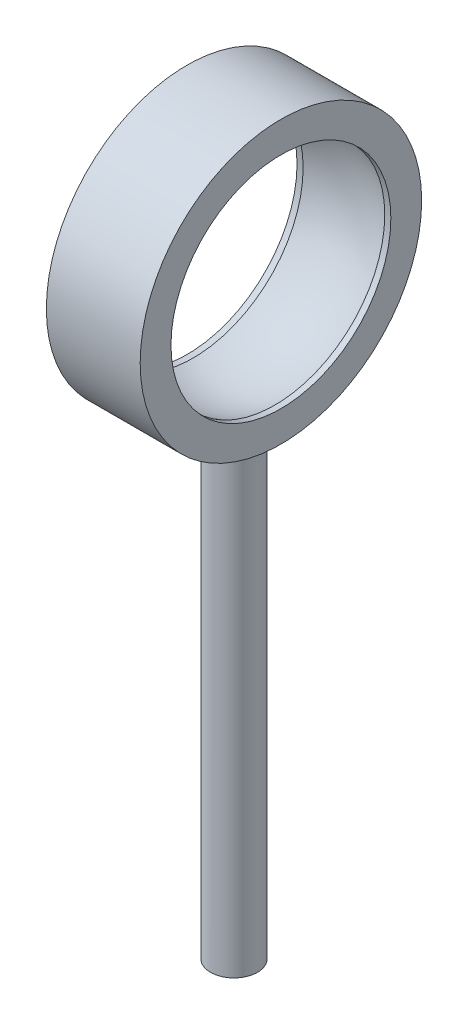
ISO-10303-21;
HEADER;
FILE_DESCRIPTION(('STEP AP214'),'2;1');
FILE_NAME('part.step','',(''),(''),'','','');
FILE_SCHEMA(('AUTOMOTIVE_DESIGN { 1 0 10303 214 1 1 1 1 }'));
ENDSEC;
DATA;
#1=APPLICATION_CONTEXT('core data for automotive mechanical design processes');
#2=APPLICATION_PROTOCOL_DEFINITION('international standard','automotive_design',2000,#1);
#3=PRODUCT_CONTEXT('',#1,'mechanical');
#4=PRODUCT('Part','Part','',(#3));
#5=PRODUCT_RELATED_PRODUCT_CATEGORY('part','',(#4));
#6=PRODUCT_DEFINITION_FORMATION('','',#4);
#7=PRODUCT_DEFINITION_CONTEXT('part definition',#1,'design');
#8=PRODUCT_DEFINITION('design','',#6,#7);
#9=PRODUCT_DEFINITION_SHAPE('','',#8);
#10=(LENGTH_UNIT() NAMED_UNIT(*) SI_UNIT(.MILLI.,.METRE.));
#11=(NAMED_UNIT(*) PLANE_ANGLE_UNIT() SI_UNIT($,.RADIAN.));
#12=(NAMED_UNIT(*) SI_UNIT($,.STERADIAN.) SOLID_ANGLE_UNIT());
#13=UNCERTAINTY_MEASURE_WITH_UNIT(LENGTH_MEASURE(1.E-05),#10,'distance_accuracy_value','');
#14=(GEOMETRIC_REPRESENTATION_CONTEXT(3) GLOBAL_UNCERTAINTY_ASSIGNED_CONTEXT((#13)) GLOBAL_UNIT_ASSIGNED_CONTEXT((#10,
#11,#12)) REPRESENTATION_CONTEXT('',''));
#15=CARTESIAN_POINT('',(0.,0.,0.));
#16=DIRECTION('',(0.,0.,1.));
#17=DIRECTION('',(1.,0.,0.));
#18=AXIS2_PLACEMENT_3D('',#15,#16,#17);
#19=CARTESIAN_POINT('',(-10.16,0.,0.));
#20=DIRECTION('',(-1.,0.,0.));
#21=DIRECTION('',(0.,0.,1.));
#22=AXIS2_PLACEMENT_3D('',#19,#20,#21);
#23=CYLINDRICAL_SURFACE('',#22,5.953125);
#24=CARTESIAN_POINT('',(-2.20970648149816,0.,0.));
#25=DIRECTION('',(-1.,0.,0.));
#26=DIRECTION('',(0.,0.,1.));
#27=AXIS2_PLACEMENT_3D('',#24,#25,#26);
#28=CIRCLE('',#27,5.953125);
#29=CARTESIAN_POINT('',(-2.20970648149816,0.,5.953125));
#30=VERTEX_POINT('',#29);
#31=EDGE_CURVE('E48',#30,#30,#28,.T.);
#32=ORIENTED_EDGE('',*,*,#31,.F.);
#33=EDGE_LOOP('',(#32));
#34=FACE_BOUND('',#33,.T.);
#35=CARTESIAN_POINT('',(-2.54,0.,0.));
#36=DIRECTION('',(-1.,0.,0.));
#37=DIRECTION('',(0.,0.,1.));
#38=AXIS2_PLACEMENT_3D('',#35,#36,#37);
#39=CIRCLE('',#38,5.953125);
#40=CARTESIAN_POINT('',(-2.54,0.,5.953125));
#41=VERTEX_POINT('',#40);
#42=EDGE_CURVE('E67',#41,#41,#39,.T.);
#43=ORIENTED_EDGE('',*,*,#42,.T.);
#44=EDGE_LOOP('',(#43));
#45=FACE_BOUND('',#44,.T.);
#46=ADVANCED_FACE('F37',(#34,#45),#23,.F.);
#47=CARTESIAN_POINT('',(0.,0.,0.));
#48=DIRECTION('',(-1.,0.,0.));
#49=DIRECTION('',(0.,1.,0.));
#50=AXIS2_PLACEMENT_3D('',#47,#48,#49);
#51=SPHERICAL_SURFACE('',#50,6.35);
#52=CARTESIAN_POINT('',(2.20970648149816,0.,0.));
#53=DIRECTION('',(-1.,0.,0.));
#54=DIRECTION('',(0.,0.,1.));
#55=AXIS2_PLACEMENT_3D('',#52,#53,#54);
#56=CIRCLE('',#55,5.953125);
#57=CARTESIAN_POINT('',(2.20970648149816,0.,5.953125));
#58=VERTEX_POINT('',#57);
#59=EDGE_CURVE('E52',#58,#58,#56,.T.);
#60=ORIENTED_EDGE('',*,*,#59,.F.);
#61=EDGE_LOOP('',(#60));
#62=FACE_BOUND('',#61,.T.);
#63=ORIENTED_EDGE('',*,*,#31,.T.);
#64=EDGE_LOOP('',(#63));
#65=FACE_BOUND('',#64,.T.);
#66=ADVANCED_FACE('F90',(#62,#65),#51,.F.);
#67=CARTESIAN_POINT('',(-10.16,0.,0.));
#68=DIRECTION('',(-1.,0.,0.));
#69=DIRECTION('',(0.,0.,1.));
#70=AXIS2_PLACEMENT_3D('',#67,#68,#69);
#71=CYLINDRICAL_SURFACE('',#70,5.953125);
#72=CARTESIAN_POINT('',(2.54,0.,0.));
#73=DIRECTION('',(-1.,0.,0.));
#74=DIRECTION('',(0.,0.,1.));
#75=AXIS2_PLACEMENT_3D('',#72,#73,#74);
#76=CIRCLE('',#75,5.953125);
#77=CARTESIAN_POINT('',(2.54,0.,5.953125));
#78=VERTEX_POINT('',#77);
#79=EDGE_CURVE('E56',#78,#78,#76,.T.);
#80=ORIENTED_EDGE('',*,*,#79,.F.);
#81=EDGE_LOOP('',(#80));
#82=FACE_BOUND('',#81,.T.);
#83=ORIENTED_EDGE('',*,*,#59,.T.);
#84=EDGE_LOOP('',(#83));
#85=FACE_BOUND('',#84,.T.);
#86=ADVANCED_FACE('F95',(#82,#85),#71,.F.);
#87=CARTESIAN_POINT('',(2.54,0.,0.));
#88=DIRECTION('',(1.,0.,0.));
#89=DIRECTION('',(0.,0.,-1.));
#90=AXIS2_PLACEMENT_3D('',#87,#88,#89);
#91=PLANE('',#90);
#92=ORIENTED_EDGE('',*,*,#79,.T.);
#93=EDGE_LOOP('',(#92));
#94=FACE_BOUND('',#93,.T.);
#95=CARTESIAN_POINT('',(2.54,0.,0.));
#96=DIRECTION('',(-1.,0.,0.));
#97=DIRECTION('',(0.,0.,1.));
#98=AXIS2_PLACEMENT_3D('',#95,#96,#97);
#99=CIRCLE('',#98,7.62);
#100=CARTESIAN_POINT('',(2.54,0.,7.62));
#101=VERTEX_POINT('',#100);
#102=EDGE_CURVE('E61',#101,#101,#99,.T.);
#103=ORIENTED_EDGE('',*,*,#102,.F.);
#104=EDGE_LOOP('',(#103));
#105=FACE_BOUND('',#104,.T.);
#106=ADVANCED_FACE('F104',(#94,#105),#91,.T.);
#107=CARTESIAN_POINT('',(-10.16,0.,0.));
#108=DIRECTION('',(-1.,0.,0.));
#109=DIRECTION('',(0.,0.,1.));
#110=AXIS2_PLACEMENT_3D('',#107,#108,#109);
#111=CYLINDRICAL_SURFACE('',#110,7.62);
#112=CARTESIAN_POINT('',(0.,-7.51342132453651,-1.27));
#113=CARTESIAN_POINT('',(-0.070802880058183,-7.51342260279848,-1.26999715439787));
#114=CARTESIAN_POINT('',(-0.141644423860634,-7.51443299014418,-1.26405902587096));
#115=CARTESIAN_POINT('',(-0.281339819955843,-7.51836168343034,-1.2404737334623));
#116=CARTESIAN_POINT('',(-0.350191778024758,-7.52128174882845,-1.22281577143731));
#117=CARTESIAN_POINT('',(-0.483866079945242,-7.5286900953574,-1.17633980818291));
#118=CARTESIAN_POINT('',(-0.548691739122486,-7.53317706555351,-1.147531133905));
#119=CARTESIAN_POINT('',(-0.672582324994564,-7.54321210234084,-1.07959474042031));
#120=CARTESIAN_POINT('',(-0.731647898944729,-7.54876004950316,-1.0404681824588));
#121=CARTESIAN_POINT('',(-0.842930927670799,-7.56035303345525,-0.952595263698884));
#122=CARTESIAN_POINT('',(-0.895083366744348,-7.5664020240215,-0.903767076857599));
#123=CARTESIAN_POINT('',(-0.990494999885649,-7.57828040180084,-0.798053778385237));
#124=CARTESIAN_POINT('',(-1.03375366686259,-7.58410977598161,-0.741168189568199));
#125=CARTESIAN_POINT('',(-1.11039380014743,-7.59493394387095,-0.62053361793376));
#126=CARTESIAN_POINT('',(-1.14371475992777,-7.59992354755596,-0.55674568938001));
#127=CARTESIAN_POINT('',(-1.19914470382951,-7.60846198374234,-0.424380975835732));
#128=CARTESIAN_POINT('',(-1.22125441696551,-7.61201090992119,-0.355804502551724));
#129=CARTESIAN_POINT('',(-1.25343540777182,-7.61724021239985,-0.216481012982878));
#130=CARTESIAN_POINT('',(-1.26361592133038,-7.61893753380339,-0.145759874433073));
#131=CARTESIAN_POINT('',(-1.27198920310952,-7.62033060306133,-0.00359424504710906));
#132=CARTESIAN_POINT('',(-1.27018278614559,-7.62002648696409,0.0678501962926765));
#133=CARTESIAN_POINT('',(-1.25471867342367,-7.61746436083146,0.208687510020065));
#134=CARTESIAN_POINT('',(-1.24117853698815,-7.61522573315738,0.278093693595668));
#135=CARTESIAN_POINT('',(-1.20281645428278,-7.60906773215991,0.413634925642786));
#136=CARTESIAN_POINT('',(-1.17799416440853,-7.60514830764711,0.47976987441896));
#137=CARTESIAN_POINT('',(-1.11765555471982,-7.59603610844074,0.607240923073581));
#138=CARTESIAN_POINT('',(-1.08209079386212,-7.59083758602055,0.668553665693671));
#139=CARTESIAN_POINT('',(-1.00131228610139,-7.5797447494032,0.78438528916209));
#140=CARTESIAN_POINT('',(-0.956097758254905,-7.5738503789092,0.838903619581261));
#141=CARTESIAN_POINT('',(-0.856651166237392,-7.56193696262159,0.940293406910902));
#142=CARTESIAN_POINT('',(-0.802316355790301,-7.55591727183369,0.987064067144626));
#143=CARTESIAN_POINT('',(-0.686517758170364,-7.54450083570681,1.07084093093161));
#144=CARTESIAN_POINT('',(-0.625053905245127,-7.53910409611433,1.10784704441446));
#145=CARTESIAN_POINT('',(-0.49662504592624,-7.52954427317403,1.17106417272005));
#146=CARTESIAN_POINT('',(-0.429653954969218,-7.52538257837721,1.19726304985785));
#147=CARTESIAN_POINT('',(-0.292176671267767,-7.51878703854459,1.23801117437433));
#148=CARTESIAN_POINT('',(-0.221670790372328,-7.51635304137267,1.25256144751012));
#149=CARTESIAN_POINT('',(-0.0800271926696368,-7.51351791386435,1.26945739751866));
#150=CARTESIAN_POINT('',(-0.00890707911133191,-7.51309285165404,1.27194676161952));
#151=CARTESIAN_POINT('',(0.132733629218937,-7.51425997669439,1.26503313296268));
#152=CARTESIAN_POINT('',(0.203254247041098,-7.51585208602981,1.25563059954133));
#153=CARTESIAN_POINT('',(0.341237701668956,-7.52085205227149,1.22532258614347));
#154=CARTESIAN_POINT('',(0.40871705905803,-7.52424835974521,1.20449024564836));
#155=CARTESIAN_POINT('',(0.539226844469979,-7.53246435086795,1.15199068061767));
#156=CARTESIAN_POINT('',(0.602257006075858,-7.53728411966414,1.12032280791527));
#157=CARTESIAN_POINT('',(0.722718693958304,-7.54785957225876,1.04671199000044));
#158=CARTESIAN_POINT('',(0.780093218960078,-7.55362347844976,1.00467696659295));
#159=CARTESIAN_POINT('',(0.887025674609062,-7.56541370673372,0.91165144857965));
#160=CARTESIAN_POINT('',(0.936583055003748,-7.57144004726148,0.86066032408309));
#161=CARTESIAN_POINT('',(1.02699916150618,-7.58315182436078,0.750533459727031));
#162=CARTESIAN_POINT('',(1.06776206375255,-7.58883306383094,0.691318532720183));
#163=CARTESIAN_POINT('',(1.13876090611848,-7.59914717115934,0.566797671558253));
#164=CARTESIAN_POINT('',(1.16899718675272,-7.60378007292748,0.501491934515074));
#165=CARTESIAN_POINT('',(1.21793537664907,-7.61145725950148,0.366927918162669));
#166=CARTESIAN_POINT('',(1.23668743047334,-7.61450844160352,0.297688285802121));
#167=CARTESIAN_POINT('',(1.26228632427363,-7.61870756249995,0.156987613316095));
#168=CARTESIAN_POINT('',(1.26913414383604,-7.6198556578969,0.0855267564653801));
#169=CARTESIAN_POINT('',(1.27070199621459,-7.62011703247015,-0.0566629680930347));
#170=CARTESIAN_POINT('',(1.26556782900206,-7.61925477428313,-0.127390225586166));
#171=CARTESIAN_POINT('',(1.24363280748714,-7.61564226620739,-0.266960082951868));
#172=CARTESIAN_POINT('',(1.22683201851314,-7.61289202689061,-0.335802693375457));
#173=CARTESIAN_POINT('',(1.18209661190377,-7.60581150324413,-0.469593394526649));
#174=CARTESIAN_POINT('',(1.15417439054909,-7.6014829785711,-0.534545729054248));
#175=CARTESIAN_POINT('',(1.08800496839507,-7.59171840493694,-0.658866070114843));
#176=CARTESIAN_POINT('',(1.04975727814903,-7.5862823034776,-0.718233811747676));
#177=CARTESIAN_POINT('',(0.963505773029304,-7.57482675846438,-0.830434176327802));
#178=CARTESIAN_POINT('',(0.915395194983507,-7.56880134471773,-0.883184126747656));
#179=CARTESIAN_POINT('',(0.811007619587717,-7.55688762078814,-0.97991364898161));
#180=CARTESIAN_POINT('',(0.754728712083094,-7.5509993430491,-1.02389116364421));
#181=CARTESIAN_POINT('',(0.635129376166119,-7.53998158533609,-1.10211324962717));
#182=CARTESIAN_POINT('',(0.571761955362271,-7.53485776734467,-1.13628677446003));
#183=CARTESIAN_POINT('',(0.440126508156991,-7.52601598792659,-1.19345178451199));
#184=CARTESIAN_POINT('',(0.371863456069978,-7.52229662289647,-1.21645444045766));
#185=CARTESIAN_POINT('',(0.252778885105853,-7.51750970377592,-1.24562923498605));
#186=CARTESIAN_POINT('',(0.202678381557114,-7.51598508697876,-1.25475360817651));
#187=CARTESIAN_POINT('',(0.101725229700717,-7.51394044725552,-1.26693995795267));
#188=CARTESIAN_POINT('',(0.0508725950642767,-7.51342040609218,-1.2700020445943));
#189=CARTESIAN_POINT('',(0.,-7.51342132453651,-1.27));
#190=B_SPLINE_CURVE_WITH_KNOTS('',3,(#112,#113,#114,#115,#116,#117,#118,#119,#120,#121,#122,
#123,#124,#125,#126,#127,#128,#129,#130,#131,#132,#133,#134,#135,#136,#137,#138,#139,#140,#141,
#142,#143,#144,#145,#146,#147,#148,#149,#150,#151,#152,#153,#154,#155,#156,#157,#158,#159,#160,
#161,#162,#163,#164,#165,#166,#167,#168,#169,#170,#171,#172,#173,#174,#175,#176,#177,#178,#179,
#180,#181,#182,#183,#184,#185,#186,#187,#188,#189),.UNSPECIFIED.,.T.,.F.,(4,2,2,2,2,2,2,2,2,2,2,
2,2,2,2,2,2,2,2,2,2,2,2,2,2,2,2,2,2,2,2,2,2,2,2,2,2,2,4),(0.,0.212222607763902,0.42464102011908,
0.636882138898486,0.849099380796682,1.06318892848892,1.27729116057688,1.49267153894398,
1.70803791034235,1.92141636273852,2.13478031081357,2.34603097549441,2.55728807436552,
2.76951238900617,2.98175388520985,3.19657030716548,3.41138871056767,3.6264477254708,
3.84148780054332,4.05395959547358,4.26642318372089,4.47754280832619,4.68867506402925,
4.90175470121242,5.11484933048579,5.33016009419763,5.54546389239952,5.75982076081954,
5.97415998921264,6.18590470340875,6.39764823192952,6.60915640232677,6.82067460037096,
7.03461634709122,7.2486082046975,7.46411373627328,7.67940331902715,7.83189020632765,
7.98437432532656),.UNSPECIFIED.);
#191=CARTESIAN_POINT('',(0.,-7.51342132453651,-1.27));
#192=VERTEX_POINT('',#191);
#193=EDGE_CURVE('E10',#192,#192,#190,.T.);
#194=ORIENTED_EDGE('',*,*,#193,.T.);
#195=EDGE_LOOP('',(#194));
#196=FACE_BOUND('',#195,.T.);
#197=CARTESIAN_POINT('',(-2.54,0.,0.));
#198=DIRECTION('',(-1.,0.,0.));
#199=DIRECTION('',(0.,0.,1.));
#200=AXIS2_PLACEMENT_3D('',#197,#198,#199);
#201=CIRCLE('',#200,7.62);
#202=CARTESIAN_POINT('',(-2.54,0.,7.62));
#203=VERTEX_POINT('',#202);
#204=EDGE_CURVE('E64',#203,#203,#201,.T.);
#205=ORIENTED_EDGE('',*,*,#204,.F.);
#206=EDGE_LOOP('',(#205));
#207=FACE_BOUND('',#206,.T.);
#208=ORIENTED_EDGE('',*,*,#102,.T.);
#209=EDGE_LOOP('',(#208));
#210=FACE_BOUND('',#209,.T.);
#211=ADVANCED_FACE('F85',(#196,#207,#210),#111,.T.);
#212=CARTESIAN_POINT('',(-2.54,0.,0.));
#213=DIRECTION('',(1.,0.,0.));
#214=DIRECTION('',(0.,0.,-1.));
#215=AXIS2_PLACEMENT_3D('',#212,#213,#214);
#216=PLANE('',#215);
#217=ORIENTED_EDGE('',*,*,#42,.F.);
#218=EDGE_LOOP('',(#217));
#219=FACE_BOUND('',#218,.T.);
#220=ORIENTED_EDGE('',*,*,#204,.T.);
#221=EDGE_LOOP('',(#220));
#222=FACE_BOUND('',#221,.T.);
#223=ADVANCED_FACE('F79',(#219,#222),#216,.F.);
#224=CARTESIAN_POINT('',(0.,-33.02,0.));
#225=DIRECTION('',(0.,-1.,0.));
#226=DIRECTION('',(0.,0.,-1.));
#227=AXIS2_PLACEMENT_3D('',#224,#225,#226);
#228=CYLINDRICAL_SURFACE('',#227,1.27);
#229=CARTESIAN_POINT('',(0.,-33.02,0.));
#230=DIRECTION('',(0.,-1.,0.));
#231=DIRECTION('',(0.,0.,-1.));
#232=AXIS2_PLACEMENT_3D('',#229,#230,#231);
#233=CIRCLE('',#232,1.27);
#234=CARTESIAN_POINT('',(0.,-33.02,-1.27));
#235=VERTEX_POINT('',#234);
#236=EDGE_CURVE('E70',#235,#235,#233,.T.);
#237=ORIENTED_EDGE('',*,*,#236,.F.);
#238=EDGE_LOOP('',(#237));
#239=FACE_BOUND('',#238,.T.);
#240=ORIENTED_EDGE('',*,*,#193,.F.);
#241=EDGE_LOOP('',(#240));
#242=FACE_BOUND('',#241,.T.);
#243=ADVANCED_FACE('F76',(#239,#242),#228,.T.);
#244=CARTESIAN_POINT('',(0.,-33.02,0.));
#245=DIRECTION('',(0.,-1.,0.));
#246=DIRECTION('',(0.,0.,-1.));
#247=AXIS2_PLACEMENT_3D('',#244,#245,#246);
#248=PLANE('',#247);
#249=ORIENTED_EDGE('',*,*,#236,.T.);
#250=EDGE_LOOP('',(#249));
#251=FACE_BOUND('',#250,.T.);
#252=ADVANCED_FACE('F74',(#251),#248,.T.);
#253=CLOSED_SHELL('',(#46,#66,#86,#106,#211,#223,#243,#252));
#254=MANIFOLD_SOLID_BREP('B2',#253);
#255=ADVANCED_BREP_SHAPE_REPRESENTATION('',(#18,#254),#14);
#256=SHAPE_DEFINITION_REPRESENTATION(#9,#255);
ENDSEC;
END-ISO-10303-21;
